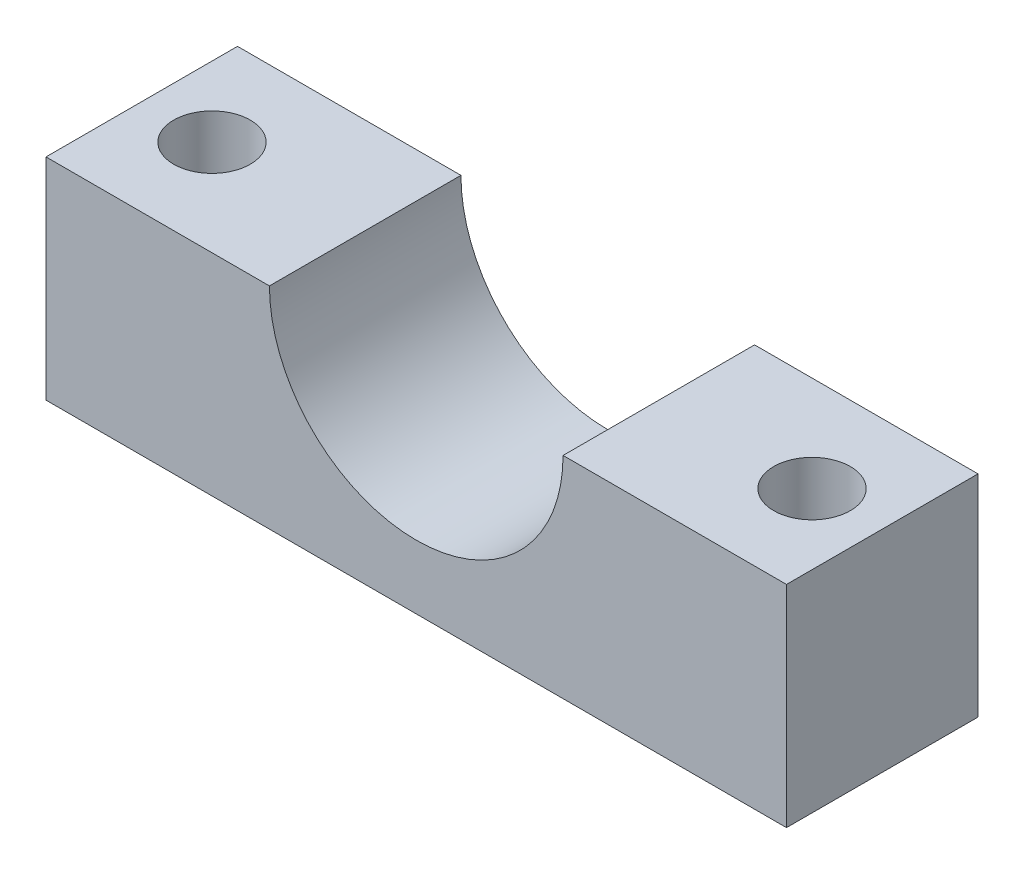
ISO-10303-21;
HEADER;
FILE_DESCRIPTION(('STEP AP214'),'2;1');
FILE_NAME('part.step','',(''),(''),'','','');
FILE_SCHEMA(('AUTOMOTIVE_DESIGN { 1 0 10303 214 1 1 1 1 }'));
ENDSEC;
DATA;
#1=APPLICATION_CONTEXT('core data for automotive mechanical design processes');
#2=APPLICATION_PROTOCOL_DEFINITION('international standard','automotive_design',2000,#1);
#3=PRODUCT_CONTEXT('',#1,'mechanical');
#4=PRODUCT('Part','Part','',(#3));
#5=PRODUCT_RELATED_PRODUCT_CATEGORY('part','',(#4));
#6=PRODUCT_DEFINITION_FORMATION('','',#4);
#7=PRODUCT_DEFINITION_CONTEXT('part definition',#1,'design');
#8=PRODUCT_DEFINITION('design','',#6,#7);
#9=PRODUCT_DEFINITION_SHAPE('','',#8);
#10=(LENGTH_UNIT() NAMED_UNIT(*) SI_UNIT(.MILLI.,.METRE.));
#11=(NAMED_UNIT(*) PLANE_ANGLE_UNIT() SI_UNIT($,.RADIAN.));
#12=(NAMED_UNIT(*) SI_UNIT($,.STERADIAN.) SOLID_ANGLE_UNIT());
#13=UNCERTAINTY_MEASURE_WITH_UNIT(LENGTH_MEASURE(1.E-05),#10,'distance_accuracy_value','');
#14=(GEOMETRIC_REPRESENTATION_CONTEXT(3) GLOBAL_UNCERTAINTY_ASSIGNED_CONTEXT((#13)) GLOBAL_UNIT_ASSIGNED_CONTEXT((#10,
#11,#12)) REPRESENTATION_CONTEXT('',''));
#15=CARTESIAN_POINT('',(0.,0.,0.));
#16=DIRECTION('',(0.,0.,1.));
#17=DIRECTION('',(1.,0.,0.));
#18=AXIS2_PLACEMENT_3D('',#15,#16,#17);
#19=CARTESIAN_POINT('',(0.,0.,15.));
#20=DIRECTION('',(0.,0.,-1.));
#21=DIRECTION('',(-1.,0.,0.));
#22=AXIS2_PLACEMENT_3D('',#19,#20,#21);
#23=CYLINDRICAL_SURFACE('',#22,11.5);
#24=CARTESIAN_POINT('',(0.,0.,0.));
#25=DIRECTION('',(0.,0.,-1.));
#26=DIRECTION('',(1.,0.,0.));
#27=AXIS2_PLACEMENT_3D('',#24,#25,#26);
#28=CIRCLE('',#27,11.5);
#29=CARTESIAN_POINT('',(11.5,0.,0.));
#30=VERTEX_POINT('',#29);
#31=CARTESIAN_POINT('',(-11.5,0.,0.));
#32=VERTEX_POINT('',#31);
#33=EDGE_CURVE('E119',#30,#32,#28,.T.);
#34=ORIENTED_EDGE('',*,*,#33,.T.);
#35=DIRECTION('',(0.,0.,-1.));
#36=VECTOR('',#35,1.);
#37=CARTESIAN_POINT('',(-11.5,0.,15.));
#38=LINE('',#37,#36);
#39=CARTESIAN_POINT('',(-11.5,0.,15.));
#40=VERTEX_POINT('',#39);
#41=EDGE_CURVE('E11',#40,#32,#38,.T.);
#42=ORIENTED_EDGE('',*,*,#41,.F.);
#43=CARTESIAN_POINT('',(0.,0.,15.));
#44=DIRECTION('',(0.,0.,-1.));
#45=DIRECTION('',(1.,0.,0.));
#46=AXIS2_PLACEMENT_3D('',#43,#44,#45);
#47=CIRCLE('',#46,11.5);
#48=CARTESIAN_POINT('',(11.5,0.,15.));
#49=VERTEX_POINT('',#48);
#50=EDGE_CURVE('E130',#49,#40,#47,.T.);
#51=ORIENTED_EDGE('',*,*,#50,.F.);
#52=DIRECTION('',(0.,0.,-1.));
#53=VECTOR('',#52,1.);
#54=CARTESIAN_POINT('',(11.5,0.,15.));
#55=LINE('',#54,#53);
#56=EDGE_CURVE('E115',#49,#30,#55,.T.);
#57=ORIENTED_EDGE('',*,*,#56,.T.);
#58=EDGE_LOOP('',(#34,#42,#51,#57));
#59=FACE_BOUND('',#58,.T.);
#60=ADVANCED_FACE('F32',(#59),#23,.F.);
#61=CARTESIAN_POINT('',(-11.5,0.,15.));
#62=DIRECTION('',(0.,-1.,0.));
#63=DIRECTION('',(1.,0.,0.));
#64=AXIS2_PLACEMENT_3D('',#61,#62,#63);
#65=PLANE('',#64);
#66=CARTESIAN_POINT('',(-23.5,0.,7.5));
#67=DIRECTION('',(0.,1.,0.));
#68=DIRECTION('',(0.,0.,1.));
#69=AXIS2_PLACEMENT_3D('',#66,#67,#68);
#70=CIRCLE('',#69,2.99999999999999);
#71=CARTESIAN_POINT('',(-23.5,0.,10.5));
#72=VERTEX_POINT('',#71);
#73=EDGE_CURVE('E250',#72,#72,#70,.T.);
#74=ORIENTED_EDGE('',*,*,#73,.F.);
#75=EDGE_LOOP('',(#74));
#76=FACE_BOUND('',#75,.T.);
#77=DIRECTION('',(-1.,0.,0.));
#78=VECTOR('',#77,1.);
#79=CARTESIAN_POINT('',(-11.5,0.,0.));
#80=LINE('',#79,#78);
#81=CARTESIAN_POINT('',(-29.,0.,0.));
#82=VERTEX_POINT('',#81);
#83=EDGE_CURVE('E122',#32,#82,#80,.T.);
#84=ORIENTED_EDGE('',*,*,#83,.T.);
#85=DIRECTION('',(0.,0.,-1.));
#86=VECTOR('',#85,1.);
#87=CARTESIAN_POINT('',(-29.,0.,15.));
#88=LINE('',#87,#86);
#89=CARTESIAN_POINT('',(-29.,0.,15.));
#90=VERTEX_POINT('',#89);
#91=EDGE_CURVE('E40',#90,#82,#88,.T.);
#92=ORIENTED_EDGE('',*,*,#91,.F.);
#93=DIRECTION('',(-1.,0.,0.));
#94=VECTOR('',#93,1.);
#95=CARTESIAN_POINT('',(-11.5,0.,15.));
#96=LINE('',#95,#94);
#97=EDGE_CURVE('E86',#40,#90,#96,.T.);
#98=ORIENTED_EDGE('',*,*,#97,.F.);
#99=ORIENTED_EDGE('',*,*,#41,.T.);
#100=EDGE_LOOP('',(#84,#92,#98,#99));
#101=FACE_BOUND('',#100,.T.);
#102=ADVANCED_FACE('F156',(#76,#101),#65,.F.);
#103=CARTESIAN_POINT('',(-29.,0.,15.));
#104=DIRECTION('',(1.,0.,0.));
#105=DIRECTION('',(0.,1.,0.));
#106=AXIS2_PLACEMENT_3D('',#103,#104,#105);
#107=PLANE('',#106);
#108=DIRECTION('',(0.,-1.,0.));
#109=VECTOR('',#108,1.);
#110=CARTESIAN_POINT('',(-29.,0.,0.));
#111=LINE('',#110,#109);
#112=CARTESIAN_POINT('',(-29.,-16.5,0.));
#113=VERTEX_POINT('',#112);
#114=EDGE_CURVE('E125',#82,#113,#111,.T.);
#115=ORIENTED_EDGE('',*,*,#114,.T.);
#116=DIRECTION('',(0.,0.,-1.));
#117=VECTOR('',#116,1.);
#118=CARTESIAN_POINT('',(-29.,-16.5,15.));
#119=LINE('',#118,#117);
#120=CARTESIAN_POINT('',(-29.,-16.5,15.));
#121=VERTEX_POINT('',#120);
#122=EDGE_CURVE('E110',#121,#113,#119,.T.);
#123=ORIENTED_EDGE('',*,*,#122,.F.);
#124=DIRECTION('',(0.,-1.,0.));
#125=VECTOR('',#124,1.);
#126=CARTESIAN_POINT('',(-29.,0.,15.));
#127=LINE('',#126,#125);
#128=EDGE_CURVE('E101',#90,#121,#127,.T.);
#129=ORIENTED_EDGE('',*,*,#128,.F.);
#130=ORIENTED_EDGE('',*,*,#91,.T.);
#131=EDGE_LOOP('',(#115,#123,#129,#130));
#132=FACE_BOUND('',#131,.T.);
#133=ADVANCED_FACE('F136',(#132),#107,.F.);
#134=CARTESIAN_POINT('',(-29.,-16.5,15.));
#135=DIRECTION('',(0.,1.,0.));
#136=DIRECTION('',(0.,0.,1.));
#137=AXIS2_PLACEMENT_3D('',#134,#135,#136);
#138=PLANE('',#137);
#139=DIRECTION('',(1.,0.,0.));
#140=VECTOR('',#139,1.);
#141=CARTESIAN_POINT('',(-29.,-16.5,0.));
#142=LINE('',#141,#140);
#143=CARTESIAN_POINT('',(29.,-16.5,0.));
#144=VERTEX_POINT('',#143);
#145=EDGE_CURVE('E109',#113,#144,#142,.T.);
#146=ORIENTED_EDGE('',*,*,#145,.T.);
#147=DIRECTION('',(0.,0.,-1.));
#148=VECTOR('',#147,1.);
#149=CARTESIAN_POINT('',(29.,-16.5,15.));
#150=LINE('',#149,#148);
#151=CARTESIAN_POINT('',(29.,-16.5,15.));
#152=VERTEX_POINT('',#151);
#153=EDGE_CURVE('E106',#152,#144,#150,.T.);
#154=ORIENTED_EDGE('',*,*,#153,.F.);
#155=DIRECTION('',(1.,0.,0.));
#156=VECTOR('',#155,1.);
#157=CARTESIAN_POINT('',(-29.,-16.5,15.));
#158=LINE('',#157,#156);
#159=EDGE_CURVE('E95',#121,#152,#158,.T.);
#160=ORIENTED_EDGE('',*,*,#159,.F.);
#161=ORIENTED_EDGE('',*,*,#122,.T.);
#162=EDGE_LOOP('',(#146,#154,#160,#161));
#163=FACE_BOUND('',#162,.T.);
#164=ADVANCED_FACE('F107',(#163),#138,.F.);
#165=CARTESIAN_POINT('',(29.,-16.5,15.));
#166=DIRECTION('',(-1.,0.,0.));
#167=DIRECTION('',(0.,0.,1.));
#168=AXIS2_PLACEMENT_3D('',#165,#166,#167);
#169=PLANE('',#168);
#170=DIRECTION('',(0.,1.,0.));
#171=VECTOR('',#170,1.);
#172=CARTESIAN_POINT('',(29.,-16.5,0.));
#173=LINE('',#172,#171);
#174=CARTESIAN_POINT('',(29.,0.,0.));
#175=VERTEX_POINT('',#174);
#176=EDGE_CURVE('E72',#144,#175,#173,.T.);
#177=ORIENTED_EDGE('',*,*,#176,.T.);
#178=DIRECTION('',(0.,0.,-1.));
#179=VECTOR('',#178,1.);
#180=CARTESIAN_POINT('',(29.,0.,15.));
#181=LINE('',#180,#179);
#182=CARTESIAN_POINT('',(29.,0.,15.));
#183=VERTEX_POINT('',#182);
#184=EDGE_CURVE('E111',#183,#175,#181,.T.);
#185=ORIENTED_EDGE('',*,*,#184,.F.);
#186=DIRECTION('',(0.,1.,0.));
#187=VECTOR('',#186,1.);
#188=CARTESIAN_POINT('',(29.,-16.5,15.));
#189=LINE('',#188,#187);
#190=EDGE_CURVE('E99',#152,#183,#189,.T.);
#191=ORIENTED_EDGE('',*,*,#190,.F.);
#192=ORIENTED_EDGE('',*,*,#153,.T.);
#193=EDGE_LOOP('',(#177,#185,#191,#192));
#194=FACE_BOUND('',#193,.T.);
#195=ADVANCED_FACE('F113',(#194),#169,.F.);
#196=CARTESIAN_POINT('',(29.,0.,15.));
#197=DIRECTION('',(0.,-1.,0.));
#198=DIRECTION('',(1.,0.,0.));
#199=AXIS2_PLACEMENT_3D('',#196,#197,#198);
#200=PLANE('',#199);
#201=CARTESIAN_POINT('',(23.5,0.,7.5));
#202=DIRECTION('',(0.,1.,0.));
#203=DIRECTION('',(0.,0.,1.));
#204=AXIS2_PLACEMENT_3D('',#201,#202,#203);
#205=CIRCLE('',#204,2.99999999999999);
#206=CARTESIAN_POINT('',(23.5,0.,10.5));
#207=VERTEX_POINT('',#206);
#208=EDGE_CURVE('E248',#207,#207,#205,.T.);
#209=ORIENTED_EDGE('',*,*,#208,.F.);
#210=EDGE_LOOP('',(#209));
#211=FACE_BOUND('',#210,.T.);
#212=DIRECTION('',(-1.,0.,0.));
#213=VECTOR('',#212,1.);
#214=CARTESIAN_POINT('',(29.,0.,0.));
#215=LINE('',#214,#213);
#216=EDGE_CURVE('E78',#175,#30,#215,.T.);
#217=ORIENTED_EDGE('',*,*,#216,.T.);
#218=ORIENTED_EDGE('',*,*,#56,.F.);
#219=DIRECTION('',(-1.,0.,0.));
#220=VECTOR('',#219,1.);
#221=CARTESIAN_POINT('',(29.,0.,15.));
#222=LINE('',#221,#220);
#223=EDGE_CURVE('E48',#183,#49,#222,.T.);
#224=ORIENTED_EDGE('',*,*,#223,.F.);
#225=ORIENTED_EDGE('',*,*,#184,.T.);
#226=EDGE_LOOP('',(#217,#218,#224,#225));
#227=FACE_BOUND('',#226,.T.);
#228=ADVANCED_FACE('F143',(#211,#227),#200,.F.);
#229=CARTESIAN_POINT('',(0.,0.,15.));
#230=DIRECTION('',(0.,0.,1.));
#231=DIRECTION('',(1.,0.,0.));
#232=AXIS2_PLACEMENT_3D('',#229,#230,#231);
#233=PLANE('',#232);
#234=ORIENTED_EDGE('',*,*,#50,.T.);
#235=ORIENTED_EDGE('',*,*,#97,.T.);
#236=ORIENTED_EDGE('',*,*,#128,.T.);
#237=ORIENTED_EDGE('',*,*,#159,.T.);
#238=ORIENTED_EDGE('',*,*,#190,.T.);
#239=ORIENTED_EDGE('',*,*,#223,.T.);
#240=EDGE_LOOP('',(#234,#235,#236,#237,#238,#239));
#241=FACE_BOUND('',#240,.T.);
#242=ADVANCED_FACE('F97',(#241),#233,.T.);
#243=CARTESIAN_POINT('',(0.,0.,0.));
#244=DIRECTION('',(0.,0.,1.));
#245=DIRECTION('',(1.,0.,0.));
#246=AXIS2_PLACEMENT_3D('',#243,#244,#245);
#247=PLANE('',#246);
#248=ORIENTED_EDGE('',*,*,#33,.F.);
#249=ORIENTED_EDGE('',*,*,#216,.F.);
#250=ORIENTED_EDGE('',*,*,#176,.F.);
#251=ORIENTED_EDGE('',*,*,#145,.F.);
#252=ORIENTED_EDGE('',*,*,#114,.F.);
#253=ORIENTED_EDGE('',*,*,#83,.F.);
#254=EDGE_LOOP('',(#248,#249,#250,#251,#252,#253));
#255=FACE_BOUND('',#254,.T.);
#256=ADVANCED_FACE('F139',(#255),#247,.F.);
#257=CARTESIAN_POINT('',(-23.5,-10.,7.5));
#258=DIRECTION('',(0.,1.,0.));
#259=DIRECTION('',(0.,0.,1.));
#260=AXIS2_PLACEMENT_3D('',#257,#258,#259);
#261=CONICAL_SURFACE('',#260,3.,1.02974425867665);
#262=CARTESIAN_POINT('',(-23.5,-11.8025818570827,7.5));
#263=VERTEX_POINT('',#262);
#264=VERTEX_LOOP('',#263);
#265=FACE_BOUND('',#264,.T.);
#266=CARTESIAN_POINT('',(-23.5,-10.,7.5));
#267=DIRECTION('',(0.,1.,0.));
#268=DIRECTION('',(0.,0.,1.));
#269=AXIS2_PLACEMENT_3D('',#266,#267,#268);
#270=CIRCLE('',#269,3.);
#271=CARTESIAN_POINT('',(-23.5,-10.,10.5));
#272=VERTEX_POINT('',#271);
#273=EDGE_CURVE('E123',#272,#272,#270,.T.);
#274=ORIENTED_EDGE('',*,*,#273,.T.);
#275=EDGE_LOOP('',(#274));
#276=FACE_BOUND('',#275,.T.);
#277=ADVANCED_FACE('F191',(#265,#276),#261,.F.);
#278=CARTESIAN_POINT('',(-23.5,0.,7.5));
#279=DIRECTION('',(0.,1.,0.));
#280=DIRECTION('',(0.,0.,1.));
#281=AXIS2_PLACEMENT_3D('',#278,#279,#280);
#282=CYLINDRICAL_SURFACE('',#281,2.99999999999999);
#283=ORIENTED_EDGE('',*,*,#273,.F.);
#284=EDGE_LOOP('',(#283));
#285=FACE_BOUND('',#284,.T.);
#286=ORIENTED_EDGE('',*,*,#73,.T.);
#287=EDGE_LOOP('',(#286));
#288=FACE_BOUND('',#287,.T.);
#289=ADVANCED_FACE('F206',(#285,#288),#282,.F.);
#290=CARTESIAN_POINT('',(23.5,-10.,7.5));
#291=DIRECTION('',(0.,1.,0.));
#292=DIRECTION('',(0.,0.,1.));
#293=AXIS2_PLACEMENT_3D('',#290,#291,#292);
#294=CONICAL_SURFACE('',#293,3.,1.02974425867665);
#295=CARTESIAN_POINT('',(23.5,-11.8025818570827,7.5));
#296=VERTEX_POINT('',#295);
#297=VERTEX_LOOP('',#296);
#298=FACE_BOUND('',#297,.T.);
#299=CARTESIAN_POINT('',(23.5,-10.,7.5));
#300=DIRECTION('',(0.,1.,0.));
#301=DIRECTION('',(0.,0.,1.));
#302=AXIS2_PLACEMENT_3D('',#299,#300,#301);
#303=CIRCLE('',#302,3.);
#304=CARTESIAN_POINT('',(23.5,-10.,10.5));
#305=VERTEX_POINT('',#304);
#306=EDGE_CURVE('E246',#305,#305,#303,.T.);
#307=ORIENTED_EDGE('',*,*,#306,.T.);
#308=EDGE_LOOP('',(#307));
#309=FACE_BOUND('',#308,.T.);
#310=ADVANCED_FACE('F215',(#298,#309),#294,.F.);
#311=CARTESIAN_POINT('',(23.5,0.,7.5));
#312=DIRECTION('',(0.,1.,0.));
#313=DIRECTION('',(0.,0.,1.));
#314=AXIS2_PLACEMENT_3D('',#311,#312,#313);
#315=CYLINDRICAL_SURFACE('',#314,2.99999999999999);
#316=ORIENTED_EDGE('',*,*,#306,.F.);
#317=EDGE_LOOP('',(#316));
#318=FACE_BOUND('',#317,.T.);
#319=ORIENTED_EDGE('',*,*,#208,.T.);
#320=EDGE_LOOP('',(#319));
#321=FACE_BOUND('',#320,.T.);
#322=ADVANCED_FACE('F229',(#318,#321),#315,.F.);
#323=CLOSED_SHELL('',(#60,#102,#133,#164,#195,#228,#242,#256,#277,#289,#310,#322));
#324=MANIFOLD_SOLID_BREP('B2',#323);
#325=ADVANCED_BREP_SHAPE_REPRESENTATION('',(#18,#324),#14);
#326=SHAPE_DEFINITION_REPRESENTATION(#9,#325);
ENDSEC;
END-ISO-10303-21;
